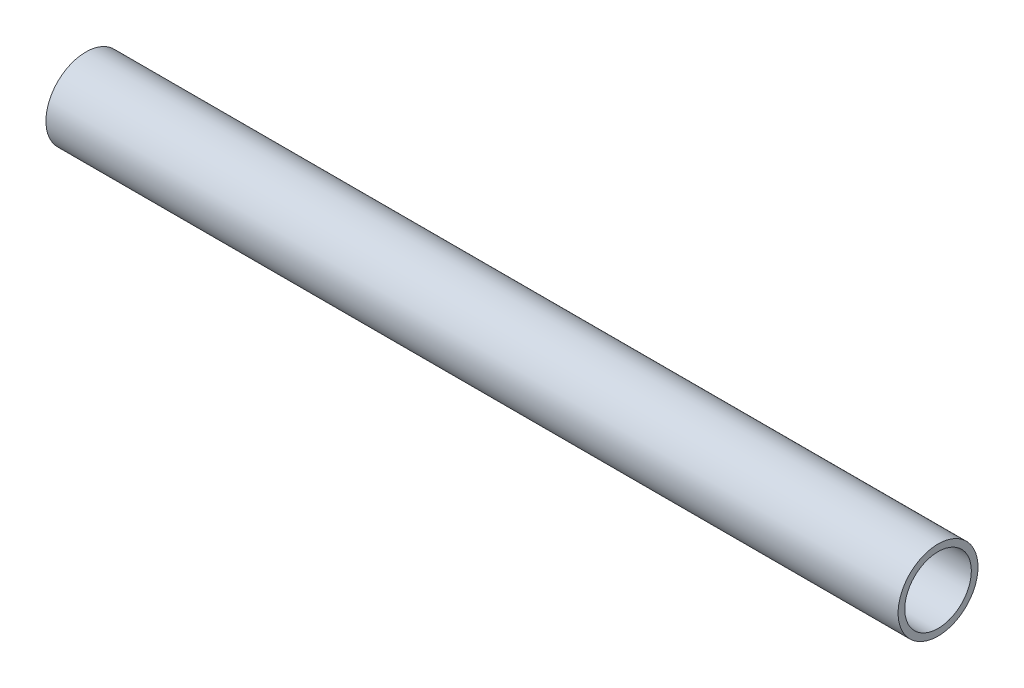
ISO-10303-21;
HEADER;
FILE_DESCRIPTION(('STEP AP214'),'2;1');
FILE_NAME('part.step','',(''),(''),'','','');
FILE_SCHEMA(('AUTOMOTIVE_DESIGN { 1 0 10303 214 1 1 1 1 }'));
ENDSEC;
DATA;
#1=APPLICATION_CONTEXT('core data for automotive mechanical design processes');
#2=APPLICATION_PROTOCOL_DEFINITION('international standard','automotive_design',2000,#1);
#3=PRODUCT_CONTEXT('',#1,'mechanical');
#4=PRODUCT('Part','Part','',(#3));
#5=PRODUCT_RELATED_PRODUCT_CATEGORY('part','',(#4));
#6=PRODUCT_DEFINITION_FORMATION('','',#4);
#7=PRODUCT_DEFINITION_CONTEXT('part definition',#1,'design');
#8=PRODUCT_DEFINITION('design','',#6,#7);
#9=PRODUCT_DEFINITION_SHAPE('','',#8);
#10=(LENGTH_UNIT() NAMED_UNIT(*) SI_UNIT(.MILLI.,.METRE.));
#11=(NAMED_UNIT(*) PLANE_ANGLE_UNIT() SI_UNIT($,.RADIAN.));
#12=(NAMED_UNIT(*) SI_UNIT($,.STERADIAN.) SOLID_ANGLE_UNIT());
#13=UNCERTAINTY_MEASURE_WITH_UNIT(LENGTH_MEASURE(1.E-05),#10,'distance_accuracy_value','');
#14=(GEOMETRIC_REPRESENTATION_CONTEXT(3) GLOBAL_UNCERTAINTY_ASSIGNED_CONTEXT((#13)) GLOBAL_UNIT_ASSIGNED_CONTEXT((#10,
#11,#12)) REPRESENTATION_CONTEXT('',''));
#15=CARTESIAN_POINT('',(0.,0.,0.));
#16=DIRECTION('',(0.,0.,1.));
#17=DIRECTION('',(1.,0.,0.));
#18=AXIS2_PLACEMENT_3D('',#15,#16,#17);
#19=CARTESIAN_POINT('',(0.,0.,0.));
#20=DIRECTION('',(1.,0.,0.));
#21=DIRECTION('',(0.,0.,-1.));
#22=AXIS2_PLACEMENT_3D('',#19,#20,#21);
#23=CYLINDRICAL_SURFACE('',#22,7.9375);
#24=CARTESIAN_POINT('',(203.2,0.,0.));
#25=DIRECTION('',(1.,0.,0.));
#26=DIRECTION('',(0.,0.,-1.));
#27=AXIS2_PLACEMENT_3D('',#24,#25,#26);
#28=CIRCLE('',#27,7.9375);
#29=CARTESIAN_POINT('',(203.2,0.,-7.9375));
#30=VERTEX_POINT('',#29);
#31=EDGE_CURVE('E18',#30,#30,#28,.F.);
#32=ORIENTED_EDGE('',*,*,#31,.F.);
#33=EDGE_LOOP('',(#32));
#34=FACE_BOUND('',#33,.T.);
#35=CARTESIAN_POINT('',(0.,0.,0.));
#36=DIRECTION('',(1.,0.,0.));
#37=DIRECTION('',(0.,0.,-1.));
#38=AXIS2_PLACEMENT_3D('',#35,#36,#37);
#39=CIRCLE('',#38,7.9375);
#40=CARTESIAN_POINT('',(0.,0.,-7.9375));
#41=VERTEX_POINT('',#40);
#42=EDGE_CURVE('E27',#41,#41,#39,.F.);
#43=ORIENTED_EDGE('',*,*,#42,.T.);
#44=EDGE_LOOP('',(#43));
#45=FACE_BOUND('',#44,.T.);
#46=ADVANCED_FACE('F15',(#34,#45),#23,.F.);
#47=CARTESIAN_POINT('',(203.2,0.,0.));
#48=DIRECTION('',(1.,0.,0.));
#49=DIRECTION('',(0.,0.,-1.));
#50=AXIS2_PLACEMENT_3D('',#47,#48,#49);
#51=PLANE('',#50);
#52=ORIENTED_EDGE('',*,*,#31,.T.);
#53=EDGE_LOOP('',(#52));
#54=FACE_BOUND('',#53,.T.);
#55=CARTESIAN_POINT('',(203.2,0.,0.));
#56=DIRECTION('',(1.,0.,0.));
#57=DIRECTION('',(0.,0.,-1.));
#58=AXIS2_PLACEMENT_3D('',#55,#56,#57);
#59=CIRCLE('',#58,9.525);
#60=CARTESIAN_POINT('',(203.2,0.,-9.525));
#61=VERTEX_POINT('',#60);
#62=EDGE_CURVE('E22',#61,#61,#59,.F.);
#63=ORIENTED_EDGE('',*,*,#62,.F.);
#64=EDGE_LOOP('',(#63));
#65=FACE_BOUND('',#64,.T.);
#66=ADVANCED_FACE('F35',(#54,#65),#51,.T.);
#67=CARTESIAN_POINT('',(0.,0.,0.));
#68=DIRECTION('',(1.,0.,0.));
#69=DIRECTION('',(0.,0.,-1.));
#70=AXIS2_PLACEMENT_3D('',#67,#68,#69);
#71=PLANE('',#70);
#72=ORIENTED_EDGE('',*,*,#42,.F.);
#73=EDGE_LOOP('',(#72));
#74=FACE_BOUND('',#73,.T.);
#75=CARTESIAN_POINT('',(0.,0.,0.));
#76=DIRECTION('',(1.,0.,0.));
#77=DIRECTION('',(0.,0.,-1.));
#78=AXIS2_PLACEMENT_3D('',#75,#76,#77);
#79=CIRCLE('',#78,9.525);
#80=CARTESIAN_POINT('',(0.,0.,-9.525));
#81=VERTEX_POINT('',#80);
#82=EDGE_CURVE('E10',#81,#81,#79,.T.);
#83=ORIENTED_EDGE('',*,*,#82,.F.);
#84=EDGE_LOOP('',(#83));
#85=FACE_BOUND('',#84,.T.);
#86=ADVANCED_FACE('F43',(#74,#85),#71,.F.);
#87=CARTESIAN_POINT('',(0.,0.,0.));
#88=DIRECTION('',(1.,0.,0.));
#89=DIRECTION('',(0.,0.,-1.));
#90=AXIS2_PLACEMENT_3D('',#87,#88,#89);
#91=CYLINDRICAL_SURFACE('',#90,9.525);
#92=ORIENTED_EDGE('',*,*,#62,.T.);
#93=EDGE_LOOP('',(#92));
#94=FACE_BOUND('',#93,.T.);
#95=ORIENTED_EDGE('',*,*,#82,.T.);
#96=EDGE_LOOP('',(#95));
#97=FACE_BOUND('',#96,.T.);
#98=ADVANCED_FACE('F44',(#94,#97),#91,.T.);
#99=CLOSED_SHELL('',(#46,#66,#86,#98));
#100=MANIFOLD_SOLID_BREP('B1',#99);
#101=ADVANCED_BREP_SHAPE_REPRESENTATION('',(#18,#100),#14);
#102=SHAPE_DEFINITION_REPRESENTATION(#9,#101);
ENDSEC;
END-ISO-10303-21;
